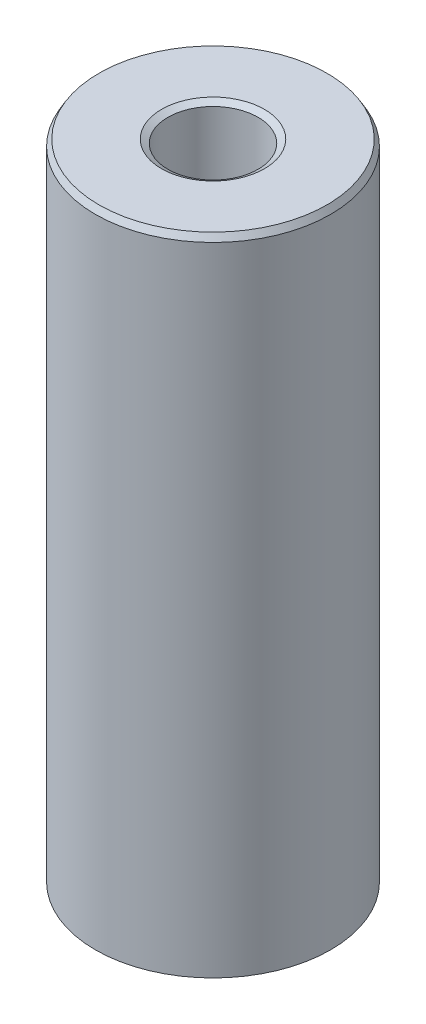
ISO-10303-21;
HEADER;
FILE_DESCRIPTION(('STEP AP214'),'2;1');
FILE_NAME('part.step','',(''),(''),'','','');
FILE_SCHEMA(('AUTOMOTIVE_DESIGN { 1 0 10303 214 1 1 1 1 }'));
ENDSEC;
DATA;
#1=APPLICATION_CONTEXT('core data for automotive mechanical design processes');
#2=APPLICATION_PROTOCOL_DEFINITION('international standard','automotive_design',2000,#1);
#3=PRODUCT_CONTEXT('',#1,'mechanical');
#4=PRODUCT('Part','Part','',(#3));
#5=PRODUCT_RELATED_PRODUCT_CATEGORY('part','',(#4));
#6=PRODUCT_DEFINITION_FORMATION('','',#4);
#7=PRODUCT_DEFINITION_CONTEXT('part definition',#1,'design');
#8=PRODUCT_DEFINITION('design','',#6,#7);
#9=PRODUCT_DEFINITION_SHAPE('','',#8);
#10=(LENGTH_UNIT() NAMED_UNIT(*) SI_UNIT(.MILLI.,.METRE.));
#11=(NAMED_UNIT(*) PLANE_ANGLE_UNIT() SI_UNIT($,.RADIAN.));
#12=(NAMED_UNIT(*) SI_UNIT($,.STERADIAN.) SOLID_ANGLE_UNIT());
#13=UNCERTAINTY_MEASURE_WITH_UNIT(LENGTH_MEASURE(1.E-05),#10,'distance_accuracy_value','');
#14=(GEOMETRIC_REPRESENTATION_CONTEXT(3) GLOBAL_UNCERTAINTY_ASSIGNED_CONTEXT((#13)) GLOBAL_UNIT_ASSIGNED_CONTEXT((#10,
#11,#12)) REPRESENTATION_CONTEXT('',''));
#15=CARTESIAN_POINT('',(0.,0.,0.));
#16=DIRECTION('',(0.,0.,1.));
#17=DIRECTION('',(1.,0.,0.));
#18=AXIS2_PLACEMENT_3D('',#15,#16,#17);
#19=CARTESIAN_POINT('',(0.,219.879496603195,0.));
#20=DIRECTION('',(0.,-1.,0.));
#21=DIRECTION('',(0.,0.,-1.));
#22=AXIS2_PLACEMENT_3D('',#19,#20,#21);
#23=CYLINDRICAL_SURFACE('',#22,40.);
#24=CARTESIAN_POINT('',(0.,1.24959328813132,0.));
#25=DIRECTION('',(0.,1.,0.));
#26=DIRECTION('',(0.,0.,1.));
#27=AXIS2_PLACEMENT_3D('',#24,#25,#26);
#28=CIRCLE('',#27,40.);
#29=CARTESIAN_POINT('',(0.,1.24959328813132,40.));
#30=VERTEX_POINT('',#29);
#31=EDGE_CURVE('E10',#30,#30,#28,.T.);
#32=ORIENTED_EDGE('',*,*,#31,.T.);
#33=EDGE_LOOP('',(#32));
#34=FACE_BOUND('',#33,.T.);
#35=CARTESIAN_POINT('',(0.,217.715137539354,0.));
#36=DIRECTION('',(0.,1.,0.));
#37=DIRECTION('',(0.,0.,1.));
#38=AXIS2_PLACEMENT_3D('',#35,#36,#37);
#39=CIRCLE('',#38,40.);
#40=CARTESIAN_POINT('',(0.,217.715137539354,40.));
#41=VERTEX_POINT('',#40);
#42=EDGE_CURVE('E50',#41,#41,#39,.F.);
#43=ORIENTED_EDGE('',*,*,#42,.T.);
#44=EDGE_LOOP('',(#43));
#45=FACE_BOUND('',#44,.T.);
#46=ADVANCED_FACE('F39',(#34,#45),#23,.T.);
#47=CARTESIAN_POINT('',(0.,219.879496603195,0.));
#48=DIRECTION('',(0.,1.,0.));
#49=DIRECTION('',(0.,0.,1.));
#50=AXIS2_PLACEMENT_3D('',#47,#48,#49);
#51=PLANE('',#50);
#52=CARTESIAN_POINT('',(0.,219.879496603195,0.));
#53=DIRECTION('',(0.,1.,0.));
#54=DIRECTION('',(0.,0.,1.));
#55=AXIS2_PLACEMENT_3D('',#52,#53,#54);
#56=CIRCLE('',#55,17.4884561549201);
#57=CARTESIAN_POINT('',(0.,219.879496603195,17.4884561549201));
#58=VERTEX_POINT('',#57);
#59=EDGE_CURVE('E58',#58,#58,#56,.F.);
#60=ORIENTED_EDGE('',*,*,#59,.T.);
#61=EDGE_LOOP('',(#60));
#62=FACE_BOUND('',#61,.T.);
#63=CARTESIAN_POINT('',(0.,219.879496603195,0.));
#64=DIRECTION('',(0.,1.,0.));
#65=DIRECTION('',(0.,0.,1.));
#66=AXIS2_PLACEMENT_3D('',#63,#64,#65);
#67=CIRCLE('',#66,38.7504067118687);
#68=CARTESIAN_POINT('',(0.,219.879496603195,38.7504067118687));
#69=VERTEX_POINT('',#68);
#70=EDGE_CURVE('E61',#69,#69,#67,.T.);
#71=ORIENTED_EDGE('',*,*,#70,.T.);
#72=EDGE_LOOP('',(#71));
#73=FACE_BOUND('',#72,.T.);
#74=ADVANCED_FACE('F88',(#62,#73),#51,.T.);
#75=CARTESIAN_POINT('',(0.,0.,0.));
#76=DIRECTION('',(0.,1.,0.));
#77=DIRECTION('',(0.,0.,1.));
#78=AXIS2_PLACEMENT_3D('',#75,#76,#77);
#79=PLANE('',#78);
#80=CARTESIAN_POINT('',(0.,0.,0.));
#81=DIRECTION('',(0.,1.,0.));
#82=DIRECTION('',(0.,0.,1.));
#83=AXIS2_PLACEMENT_3D('',#80,#81,#82);
#84=CIRCLE('',#83,16.5736903792109);
#85=CARTESIAN_POINT('',(0.,0.,16.5736903792109));
#86=VERTEX_POINT('',#85);
#87=EDGE_CURVE('E51',#86,#86,#84,.T.);
#88=ORIENTED_EDGE('',*,*,#87,.T.);
#89=EDGE_LOOP('',(#88));
#90=FACE_BOUND('',#89,.T.);
#91=CARTESIAN_POINT('',(0.,0.,0.));
#92=DIRECTION('',(0.,1.,0.));
#93=DIRECTION('',(0.,0.,1.));
#94=AXIS2_PLACEMENT_3D('',#91,#92,#93);
#95=CIRCLE('',#94,37.8356409361595);
#96=CARTESIAN_POINT('',(0.,0.,37.8356409361595));
#97=VERTEX_POINT('',#96);
#98=EDGE_CURVE('E54',#97,#97,#95,.F.);
#99=ORIENTED_EDGE('',*,*,#98,.T.);
#100=EDGE_LOOP('',(#99));
#101=FACE_BOUND('',#100,.T.);
#102=ADVANCED_FACE('F83',(#90,#101),#79,.F.);
#103=CARTESIAN_POINT('',(0.,219.879496603195,0.));
#104=DIRECTION('',(0.,-1.,0.));
#105=DIRECTION('',(0.,0.,-1.));
#106=AXIS2_PLACEMENT_3D('',#103,#104,#105);
#107=CYLINDRICAL_SURFACE('',#106,15.3240970910796);
#108=CARTESIAN_POINT('',(0.,218.629903315063,0.));
#109=DIRECTION('',(0.,1.,0.));
#110=DIRECTION('',(0.,0.,1.));
#111=AXIS2_PLACEMENT_3D('',#108,#109,#110);
#112=CIRCLE('',#111,15.3240970910796);
#113=CARTESIAN_POINT('',(0.,218.629903315063,15.3240970910796));
#114=VERTEX_POINT('',#113);
#115=EDGE_CURVE('E67',#114,#114,#112,.T.);
#116=ORIENTED_EDGE('',*,*,#115,.T.);
#117=EDGE_LOOP('',(#116));
#118=FACE_BOUND('',#117,.T.);
#119=CARTESIAN_POINT('',(0.,2.16435906384052,0.));
#120=DIRECTION('',(0.,1.,0.));
#121=DIRECTION('',(0.,0.,1.));
#122=AXIS2_PLACEMENT_3D('',#119,#120,#121);
#123=CIRCLE('',#122,15.3240970910796);
#124=CARTESIAN_POINT('',(0.,2.16435906384052,15.3240970910796));
#125=VERTEX_POINT('',#124);
#126=EDGE_CURVE('E69',#125,#125,#123,.F.);
#127=ORIENTED_EDGE('',*,*,#126,.T.);
#128=EDGE_LOOP('',(#127));
#129=FACE_BOUND('',#128,.T.);
#130=ADVANCED_FACE('F71',(#118,#129),#107,.F.);
#131=CARTESIAN_POINT('',(0.,218.629903315063,0.));
#132=DIRECTION('',(0.,1.,0.));
#133=DIRECTION('',(0.,0.,1.));
#134=AXIS2_PLACEMENT_3D('',#131,#132,#133);
#135=CONICAL_SURFACE('',#134,15.3240970910796,1.0471975511966);
#136=ORIENTED_EDGE('',*,*,#59,.F.);
#137=EDGE_LOOP('',(#136));
#138=FACE_BOUND('',#137,.T.);
#139=ORIENTED_EDGE('',*,*,#115,.F.);
#140=EDGE_LOOP('',(#139));
#141=FACE_BOUND('',#140,.T.);
#142=ADVANCED_FACE('F77',(#138,#141),#135,.F.);
#143=CARTESIAN_POINT('',(0.,0.,0.));
#144=DIRECTION('',(0.,-1.,0.));
#145=DIRECTION('',(0.,0.,-1.));
#146=AXIS2_PLACEMENT_3D('',#143,#144,#145);
#147=CONICAL_SURFACE('',#146,16.5736903792109,0.523598775598291);
#148=ORIENTED_EDGE('',*,*,#126,.F.);
#149=EDGE_LOOP('',(#148));
#150=FACE_BOUND('',#149,.T.);
#151=ORIENTED_EDGE('',*,*,#87,.F.);
#152=EDGE_LOOP('',(#151));
#153=FACE_BOUND('',#152,.T.);
#154=ADVANCED_FACE('F73',(#150,#153),#147,.F.);
#155=CARTESIAN_POINT('',(0.,1.24959328813132,0.));
#156=DIRECTION('',(0.,1.,0.));
#157=DIRECTION('',(0.,0.,1.));
#158=AXIS2_PLACEMENT_3D('',#155,#156,#157);
#159=CONICAL_SURFACE('',#158,40.,1.04719755119661);
#160=ORIENTED_EDGE('',*,*,#98,.F.);
#161=EDGE_LOOP('',(#160));
#162=FACE_BOUND('',#161,.T.);
#163=ORIENTED_EDGE('',*,*,#31,.F.);
#164=EDGE_LOOP('',(#163));
#165=FACE_BOUND('',#164,.T.);
#166=ADVANCED_FACE('F76',(#162,#165),#159,.T.);
#167=CARTESIAN_POINT('',(0.,219.879496603195,0.));
#168=DIRECTION('',(0.,-1.,0.));
#169=DIRECTION('',(0.,0.,-1.));
#170=AXIS2_PLACEMENT_3D('',#167,#168,#169);
#171=CONICAL_SURFACE('',#170,38.7504067118687,0.523598775598292);
#172=ORIENTED_EDGE('',*,*,#42,.F.);
#173=EDGE_LOOP('',(#172));
#174=FACE_BOUND('',#173,.T.);
#175=ORIENTED_EDGE('',*,*,#70,.F.);
#176=EDGE_LOOP('',(#175));
#177=FACE_BOUND('',#176,.T.);
#178=ADVANCED_FACE('F45',(#174,#177),#171,.T.);
#179=CLOSED_SHELL('',(#46,#74,#102,#130,#142,#154,#166,#178));
#180=MANIFOLD_SOLID_BREP('B2',#179);
#181=ADVANCED_BREP_SHAPE_REPRESENTATION('',(#18,#180),#14);
#182=SHAPE_DEFINITION_REPRESENTATION(#9,#181);
ENDSEC;
END-ISO-10303-21;
